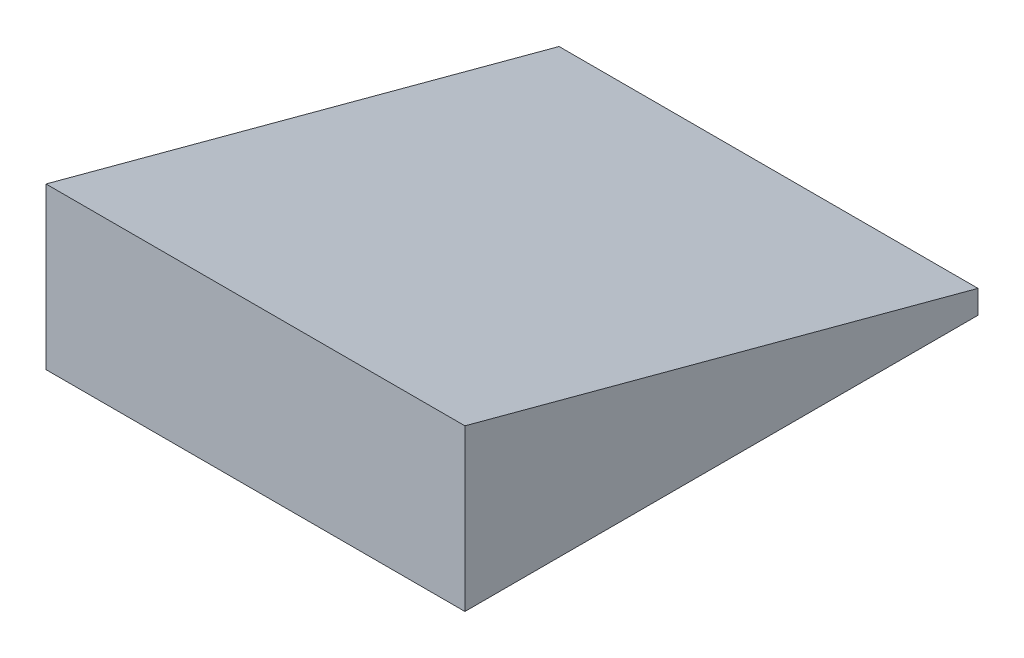
ISO-10303-21;
HEADER;
FILE_DESCRIPTION(('STEP AP214'),'2;1');
FILE_NAME('part.step','',(''),(''),'','','');
FILE_SCHEMA(('AUTOMOTIVE_DESIGN { 1 0 10303 214 1 1 1 1 }'));
ENDSEC;
DATA;
#1=APPLICATION_CONTEXT('core data for automotive mechanical design processes');
#2=APPLICATION_PROTOCOL_DEFINITION('international standard','automotive_design',2000,#1);
#3=PRODUCT_CONTEXT('',#1,'mechanical');
#4=PRODUCT('Part','Part','',(#3));
#5=PRODUCT_RELATED_PRODUCT_CATEGORY('part','',(#4));
#6=PRODUCT_DEFINITION_FORMATION('','',#4);
#7=PRODUCT_DEFINITION_CONTEXT('part definition',#1,'design');
#8=PRODUCT_DEFINITION('design','',#6,#7);
#9=PRODUCT_DEFINITION_SHAPE('','',#8);
#10=(LENGTH_UNIT() NAMED_UNIT(*) SI_UNIT(.MILLI.,.METRE.));
#11=(NAMED_UNIT(*) PLANE_ANGLE_UNIT() SI_UNIT($,.RADIAN.));
#12=(NAMED_UNIT(*) SI_UNIT($,.STERADIAN.) SOLID_ANGLE_UNIT());
#13=UNCERTAINTY_MEASURE_WITH_UNIT(LENGTH_MEASURE(1.E-05),#10,'distance_accuracy_value','');
#14=(GEOMETRIC_REPRESENTATION_CONTEXT(3) GLOBAL_UNCERTAINTY_ASSIGNED_CONTEXT((#13)) GLOBAL_UNIT_ASSIGNED_CONTEXT((#10,
#11,#12)) REPRESENTATION_CONTEXT('',''));
#15=CARTESIAN_POINT('',(0.,0.,0.));
#16=DIRECTION('',(0.,0.,1.));
#17=DIRECTION('',(1.,0.,0.));
#18=AXIS2_PLACEMENT_3D('',#15,#16,#17);
#19=CARTESIAN_POINT('',(4.10199628109473,5.,15.8695526226784));
#20=DIRECTION('',(-1.,0.,0.));
#21=DIRECTION('',(0.,0.,1.));
#22=AXIS2_PLACEMENT_3D('',#19,#20,#21);
#23=PLANE('',#22);
#24=DIRECTION('',(0.,0.258819045102521,0.965925826289068));
#25=VECTOR('',#24,1.);
#26=CARTESIAN_POINT('',(4.10199628109473,60.3627388632527,-16.1741471313393));
#27=LINE('',#26,#25);
#28=CARTESIAN_POINT('',(4.10199628109473,9.99999999999999,-204.130447377322));
#29=VERTEX_POINT('',#28);
#30=CARTESIAN_POINT('',(4.10199628109473,68.9488223348471,15.8695526226784));
#31=VERTEX_POINT('',#30);
#32=EDGE_CURVE('E71',#29,#31,#27,.T.);
#33=ORIENTED_EDGE('',*,*,#32,.T.);
#34=DIRECTION('',(0.,-1.,0.));
#35=VECTOR('',#34,1.);
#36=CARTESIAN_POINT('',(4.10199628109473,5.,15.8695526226784));
#37=LINE('',#36,#35);
#38=CARTESIAN_POINT('',(4.10199628109473,0.,15.8695526226784));
#39=VERTEX_POINT('',#38);
#40=EDGE_CURVE('E55',#31,#39,#37,.T.);
#41=ORIENTED_EDGE('',*,*,#40,.T.);
#42=DIRECTION('',(0.,0.,-1.));
#43=VECTOR('',#42,1.);
#44=CARTESIAN_POINT('',(4.10199628109473,0.,15.8695526226784));
#45=LINE('',#44,#43);
#46=CARTESIAN_POINT('',(4.10199628109473,0.,-204.130447377322));
#47=VERTEX_POINT('',#46);
#48=EDGE_CURVE('E85',#39,#47,#45,.T.);
#49=ORIENTED_EDGE('',*,*,#48,.T.);
#50=DIRECTION('',(0.,-1.,0.));
#51=VECTOR('',#50,1.);
#52=CARTESIAN_POINT('',(4.10199628109473,5.,-204.130447377322));
#53=LINE('',#52,#51);
#54=EDGE_CURVE('E11',#29,#47,#53,.T.);
#55=ORIENTED_EDGE('',*,*,#54,.F.);
#56=EDGE_LOOP('',(#33,#41,#49,#55));
#57=FACE_BOUND('',#56,.T.);
#58=ADVANCED_FACE('F33',(#57),#23,.F.);
#59=CARTESIAN_POINT('',(4.10199628109473,5.,-204.130447377322));
#60=DIRECTION('',(0.,0.,1.));
#61=DIRECTION('',(1.,0.,0.));
#62=AXIS2_PLACEMENT_3D('',#59,#60,#61);
#63=PLANE('',#62);
#64=DIRECTION('',(1.,0.,0.));
#65=VECTOR('',#64,1.);
#66=CARTESIAN_POINT('',(-370.898003718905,9.99999999999999,-204.130447377322));
#67=LINE('',#66,#65);
#68=CARTESIAN_POINT('',(-175.528003718905,9.99999999999999,-204.130447377322));
#69=VERTEX_POINT('',#68);
#70=EDGE_CURVE('E74',#69,#29,#67,.T.);
#71=ORIENTED_EDGE('',*,*,#70,.T.);
#72=ORIENTED_EDGE('',*,*,#54,.T.);
#73=DIRECTION('',(-1.,0.,0.));
#74=VECTOR('',#73,1.);
#75=CARTESIAN_POINT('',(4.10199628109473,0.,-204.130447377322));
#76=LINE('',#75,#74);
#77=CARTESIAN_POINT('',(-175.528003718905,0.,-204.130447377322));
#78=VERTEX_POINT('',#77);
#79=EDGE_CURVE('E88',#47,#78,#76,.T.);
#80=ORIENTED_EDGE('',*,*,#79,.T.);
#81=DIRECTION('',(0.,-1.,0.));
#82=VECTOR('',#81,1.);
#83=CARTESIAN_POINT('',(-175.528003718905,5.,-204.130447377322));
#84=LINE('',#83,#82);
#85=EDGE_CURVE('E40',#69,#78,#84,.T.);
#86=ORIENTED_EDGE('',*,*,#85,.F.);
#87=EDGE_LOOP('',(#71,#72,#80,#86));
#88=FACE_BOUND('',#87,.T.);
#89=ADVANCED_FACE('F80',(#88),#63,.F.);
#90=CARTESIAN_POINT('',(-175.528003718905,5.,15.8695526226784));
#91=DIRECTION('',(1.,0.,0.));
#92=DIRECTION('',(0.,0.,-1.));
#93=AXIS2_PLACEMENT_3D('',#90,#91,#92);
#94=PLANE('',#93);
#95=DIRECTION('',(0.,0.258819045102521,0.965925826289068));
#96=VECTOR('',#95,1.);
#97=CARTESIAN_POINT('',(-175.528003718905,64.6650635094612,-0.117652961033384));
#98=LINE('',#97,#96);
#99=CARTESIAN_POINT('',(-175.528003718905,68.9488223348471,15.8695526226784));
#100=VERTEX_POINT('',#99);
#101=EDGE_CURVE('E47',#69,#100,#98,.T.);
#102=ORIENTED_EDGE('',*,*,#101,.F.);
#103=ORIENTED_EDGE('',*,*,#85,.T.);
#104=DIRECTION('',(0.,0.,1.));
#105=VECTOR('',#104,1.);
#106=CARTESIAN_POINT('',(-175.528003718905,0.,15.8695526226784));
#107=LINE('',#106,#105);
#108=CARTESIAN_POINT('',(-175.528003718905,0.,15.8695526226784));
#109=VERTEX_POINT('',#108);
#110=EDGE_CURVE('E90',#78,#109,#107,.T.);
#111=ORIENTED_EDGE('',*,*,#110,.T.);
#112=DIRECTION('',(0.,-1.,0.));
#113=VECTOR('',#112,1.);
#114=CARTESIAN_POINT('',(-175.528003718905,5.,15.8695526226784));
#115=LINE('',#114,#113);
#116=EDGE_CURVE('E99',#100,#109,#115,.T.);
#117=ORIENTED_EDGE('',*,*,#116,.F.);
#118=EDGE_LOOP('',(#102,#103,#111,#117));
#119=FACE_BOUND('',#118,.T.);
#120=ADVANCED_FACE('F101',(#119),#94,.F.);
#121=CARTESIAN_POINT('',(4.10199628109473,5.,15.8695526226784));
#122=DIRECTION('',(0.,0.,-1.));
#123=DIRECTION('',(-1.,0.,0.));
#124=AXIS2_PLACEMENT_3D('',#121,#122,#123);
#125=PLANE('',#124);
#126=DIRECTION('',(1.,0.,0.));
#127=VECTOR('',#126,1.);
#128=CARTESIAN_POINT('',(-370.898003718905,68.9488223348471,15.8695526226784));
#129=LINE('',#128,#127);
#130=EDGE_CURVE('E75',#100,#31,#129,.T.);
#131=ORIENTED_EDGE('',*,*,#130,.F.);
#132=ORIENTED_EDGE('',*,*,#116,.T.);
#133=DIRECTION('',(1.,0.,0.));
#134=VECTOR('',#133,1.);
#135=CARTESIAN_POINT('',(4.10199628109473,0.,15.8695526226784));
#136=LINE('',#135,#134);
#137=EDGE_CURVE('E96',#109,#39,#136,.T.);
#138=ORIENTED_EDGE('',*,*,#137,.T.);
#139=ORIENTED_EDGE('',*,*,#40,.F.);
#140=EDGE_LOOP('',(#131,#132,#138,#139));
#141=FACE_BOUND('',#140,.T.);
#142=ADVANCED_FACE('F106',(#141),#125,.F.);
#143=CARTESIAN_POINT('',(0.,0.,0.));
#144=DIRECTION('',(0.,1.,0.));
#145=DIRECTION('',(0.,0.,1.));
#146=AXIS2_PLACEMENT_3D('',#143,#144,#145);
#147=PLANE('',#146);
#148=ORIENTED_EDGE('',*,*,#48,.F.);
#149=ORIENTED_EDGE('',*,*,#137,.F.);
#150=ORIENTED_EDGE('',*,*,#110,.F.);
#151=ORIENTED_EDGE('',*,*,#79,.F.);
#152=EDGE_LOOP('',(#148,#149,#150,#151));
#153=FACE_BOUND('',#152,.T.);
#154=ADVANCED_FACE('F104',(#153),#147,.F.);
#155=CARTESIAN_POINT('',(-370.898003718905,60.3627388632527,-16.1741471313393));
#156=DIRECTION('',(0.,0.965925826289068,-0.258819045102521));
#157=DIRECTION('',(0.,0.258819045102521,0.965925826289068));
#158=AXIS2_PLACEMENT_3D('',#155,#156,#157);
#159=PLANE('',#158);
#160=ORIENTED_EDGE('',*,*,#101,.T.);
#161=ORIENTED_EDGE('',*,*,#130,.T.);
#162=ORIENTED_EDGE('',*,*,#32,.F.);
#163=ORIENTED_EDGE('',*,*,#70,.F.);
#164=EDGE_LOOP('',(#160,#161,#162,#163));
#165=FACE_BOUND('',#164,.T.);
#166=ADVANCED_FACE('F73',(#165),#159,.T.);
#167=CLOSED_SHELL('',(#58,#89,#120,#142,#154,#166));
#168=MANIFOLD_SOLID_BREP('B2',#167);
#169=ADVANCED_BREP_SHAPE_REPRESENTATION('',(#18,#168),#14);
#170=SHAPE_DEFINITION_REPRESENTATION(#9,#169);
ENDSEC;
END-ISO-10303-21;
